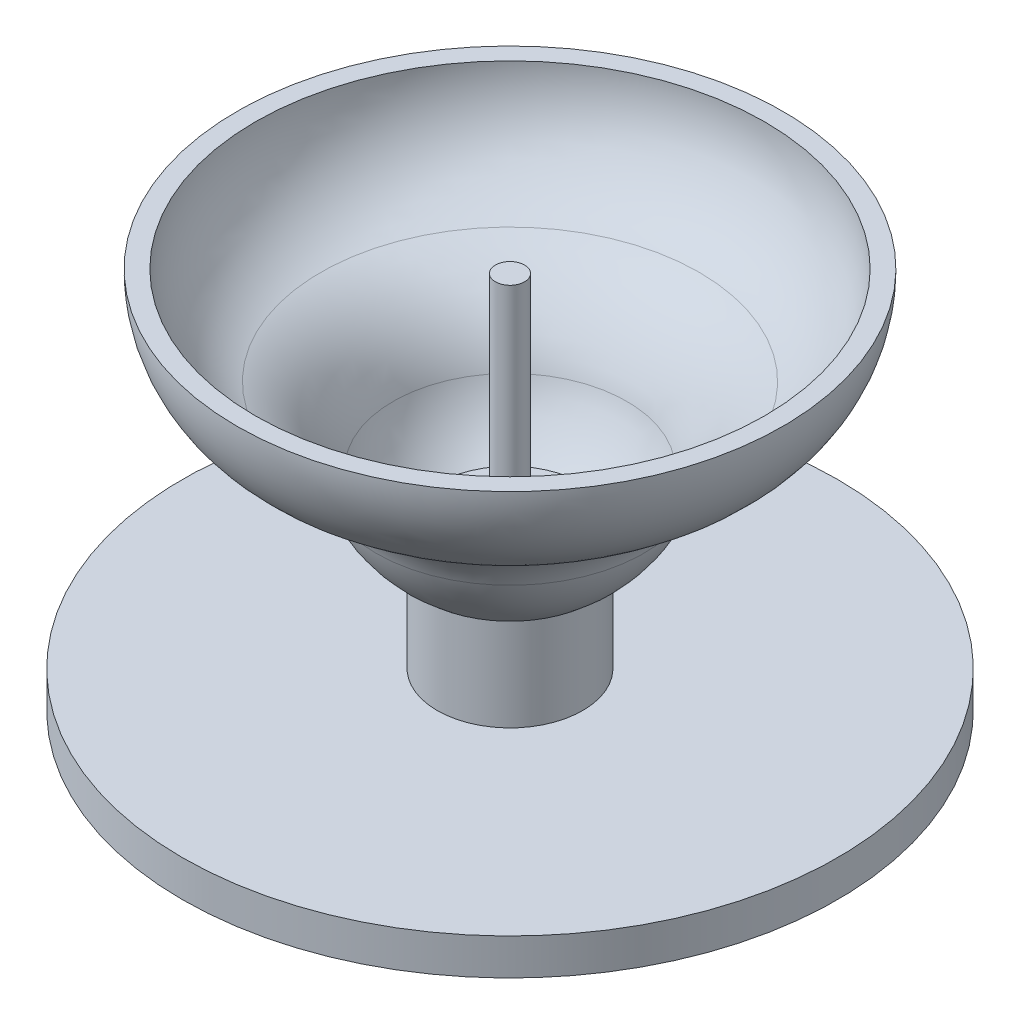
ISO-10303-21;
HEADER;
FILE_DESCRIPTION(('STEP AP214'),'2;1');
FILE_NAME('part.step','',(''),(''),'','','');
FILE_SCHEMA(('AUTOMOTIVE_DESIGN { 1 0 10303 214 1 1 1 1 }'));
ENDSEC;
DATA;
#1=APPLICATION_CONTEXT('core data for automotive mechanical design processes');
#2=APPLICATION_PROTOCOL_DEFINITION('international standard','automotive_design',2000,#1);
#3=PRODUCT_CONTEXT('',#1,'mechanical');
#4=PRODUCT('Part','Part','',(#3));
#5=PRODUCT_RELATED_PRODUCT_CATEGORY('part','',(#4));
#6=PRODUCT_DEFINITION_FORMATION('','',#4);
#7=PRODUCT_DEFINITION_CONTEXT('part definition',#1,'design');
#8=PRODUCT_DEFINITION('design','',#6,#7);
#9=PRODUCT_DEFINITION_SHAPE('','',#8);
#10=(LENGTH_UNIT() NAMED_UNIT(*) SI_UNIT(.MILLI.,.METRE.));
#11=(NAMED_UNIT(*) PLANE_ANGLE_UNIT() SI_UNIT($,.RADIAN.));
#12=(NAMED_UNIT(*) SI_UNIT($,.STERADIAN.) SOLID_ANGLE_UNIT());
#13=UNCERTAINTY_MEASURE_WITH_UNIT(LENGTH_MEASURE(1.E-05),#10,'distance_accuracy_value','');
#14=(GEOMETRIC_REPRESENTATION_CONTEXT(3) GLOBAL_UNCERTAINTY_ASSIGNED_CONTEXT((#13)) GLOBAL_UNIT_ASSIGNED_CONTEXT((#10,
#11,#12)) REPRESENTATION_CONTEXT('',''));
#15=CARTESIAN_POINT('',(0.,0.,0.));
#16=DIRECTION('',(0.,0.,1.));
#17=DIRECTION('',(1.,0.,0.));
#18=AXIS2_PLACEMENT_3D('',#15,#16,#17);
#19=CARTESIAN_POINT('',(0.,103.,0.));
#20=DIRECTION('',(0.,-1.,0.));
#21=DIRECTION('',(0.,0.,-1.));
#22=AXIS2_PLACEMENT_3D('',#19,#20,#21);
#23=CYLINDRICAL_SURFACE('',#22,20.);
#24=CARTESIAN_POINT('',(0.,41.4705656902837,0.));
#25=DIRECTION('',(0.,1.,0.));
#26=DIRECTION('',(0.,0.,1.));
#27=AXIS2_PLACEMENT_3D('',#24,#25,#26);
#28=CIRCLE('',#27,20.);
#29=CARTESIAN_POINT('',(0.,41.4705656902837,20.));
#30=VERTEX_POINT('',#29);
#31=EDGE_CURVE('E58',#30,#30,#28,.F.);
#32=ORIENTED_EDGE('',*,*,#31,.F.);
#33=EDGE_LOOP('',(#32));
#34=FACE_BOUND('',#33,.T.);
#35=CARTESIAN_POINT('',(0.,44.,0.));
#36=DIRECTION('',(0.,1.,0.));
#37=DIRECTION('',(0.,0.,1.));
#38=AXIS2_PLACEMENT_3D('',#35,#36,#37);
#39=CIRCLE('',#38,20.);
#40=CARTESIAN_POINT('',(0.,44.,20.));
#41=VERTEX_POINT('',#40);
#42=EDGE_CURVE('E70',#41,#41,#39,.T.);
#43=ORIENTED_EDGE('',*,*,#42,.F.);
#44=EDGE_LOOP('',(#43));
#45=FACE_BOUND('',#44,.T.);
#46=ADVANCED_FACE('F54',(#34,#45),#23,.T.);
#47=CARTESIAN_POINT('',(0.,10.,0.));
#48=DIRECTION('',(0.,-1.,0.));
#49=DIRECTION('',(0.,0.,-1.));
#50=AXIS2_PLACEMENT_3D('',#47,#48,#49);
#51=CYLINDRICAL_SURFACE('',#50,90.);
#52=CARTESIAN_POINT('',(0.,10.,0.));
#53=DIRECTION('',(0.,1.,0.));
#54=DIRECTION('',(0.,0.,1.));
#55=AXIS2_PLACEMENT_3D('',#52,#53,#54);
#56=CIRCLE('',#55,90.);
#57=CARTESIAN_POINT('',(0.,10.,90.));
#58=VERTEX_POINT('',#57);
#59=EDGE_CURVE('E131',#58,#58,#56,.T.);
#60=ORIENTED_EDGE('',*,*,#59,.F.);
#61=EDGE_LOOP('',(#60));
#62=FACE_BOUND('',#61,.T.);
#63=CARTESIAN_POINT('',(0.,0.,0.));
#64=DIRECTION('',(0.,1.,0.));
#65=DIRECTION('',(0.,0.,1.));
#66=AXIS2_PLACEMENT_3D('',#63,#64,#65);
#67=CIRCLE('',#66,90.);
#68=CARTESIAN_POINT('',(0.,0.,90.));
#69=VERTEX_POINT('',#68);
#70=EDGE_CURVE('E128',#69,#69,#67,.T.);
#71=ORIENTED_EDGE('',*,*,#70,.T.);
#72=EDGE_LOOP('',(#71));
#73=FACE_BOUND('',#72,.T.);
#74=ADVANCED_FACE('F56',(#62,#73),#51,.T.);
#75=CARTESIAN_POINT('',(0.,10.,0.));
#76=DIRECTION('',(0.,1.,0.));
#77=DIRECTION('',(0.,0.,1.));
#78=AXIS2_PLACEMENT_3D('',#75,#76,#77);
#79=PLANE('',#78);
#80=CARTESIAN_POINT('',(0.,10.,0.));
#81=DIRECTION('',(0.,1.,0.));
#82=DIRECTION('',(0.,0.,1.));
#83=AXIS2_PLACEMENT_3D('',#80,#81,#82);
#84=CIRCLE('',#83,20.);
#85=CARTESIAN_POINT('',(0.,10.,20.));
#86=VERTEX_POINT('',#85);
#87=EDGE_CURVE('E66',#86,#86,#84,.T.);
#88=ORIENTED_EDGE('',*,*,#87,.F.);
#89=EDGE_LOOP('',(#88));
#90=FACE_BOUND('',#89,.T.);
#91=ORIENTED_EDGE('',*,*,#59,.T.);
#92=EDGE_LOOP('',(#91));
#93=FACE_BOUND('',#92,.T.);
#94=ADVANCED_FACE('F166',(#90,#93),#79,.T.);
#95=CARTESIAN_POINT('',(0.,0.,0.));
#96=DIRECTION('',(0.,1.,0.));
#97=DIRECTION('',(0.,0.,1.));
#98=AXIS2_PLACEMENT_3D('',#95,#96,#97);
#99=PLANE('',#98);
#100=CARTESIAN_POINT('',(0.,0.,0.));
#101=DIRECTION('',(0.,-1.,0.));
#102=DIRECTION('',(0.,0.,-1.));
#103=AXIS2_PLACEMENT_3D('',#100,#101,#102);
#104=CIRCLE('',#103,75.);
#105=CARTESIAN_POINT('',(0.,0.,-75.));
#106=VERTEX_POINT('',#105);
#107=EDGE_CURVE('E119',#106,#106,#104,.T.);
#108=ORIENTED_EDGE('',*,*,#107,.F.);
#109=EDGE_LOOP('',(#108));
#110=FACE_BOUND('',#109,.T.);
#111=ORIENTED_EDGE('',*,*,#70,.F.);
#112=EDGE_LOOP('',(#111));
#113=FACE_BOUND('',#112,.T.);
#114=ADVANCED_FACE('F174',(#110,#113),#99,.F.);
#115=CARTESIAN_POINT('',(0.,35.4949580064516,0.));
#116=DIRECTION('',(0.,1.,0.));
#117=DIRECTION('',(0.,0.,1.));
#118=AXIS2_PLACEMENT_3D('',#115,#116,#117);
#119=CIRCLE('',#118,20.);
#120=CARTESIAN_POINT('',(0.,35.4949580064516,20.));
#121=VERTEX_POINT('',#120);
#122=EDGE_CURVE('E91',#121,#121,#119,.F.);
#123=ORIENTED_EDGE('',*,*,#122,.T.);
#124=EDGE_LOOP('',(#123));
#125=FACE_BOUND('',#124,.T.);
#126=ORIENTED_EDGE('',*,*,#87,.T.);
#127=EDGE_LOOP('',(#126));
#128=FACE_BOUND('',#127,.T.);
#129=ADVANCED_FACE('F138',(#125,#128),#23,.T.);
#130=CARTESIAN_POINT('',(0.,0.,0.));
#131=DIRECTION('',(0.,1.,0.));
#132=DIRECTION('',(0.,0.,-1.));
#133=AXIS2_PLACEMENT_3D('',#130,#131,#132);
#134=CONICAL_SURFACE('',#133,72.,0.5235987755983);
#135=CARTESIAN_POINT('',(0.,1.,0.));
#136=DIRECTION('',(0.,-1.,0.));
#137=DIRECTION('',(0.,0.,-1.));
#138=AXIS2_PLACEMENT_3D('',#135,#136,#137);
#139=CIRCLE('',#138,72.5773502691896);
#140=CARTESIAN_POINT('',(0.,1.,-72.5773502691896));
#141=VERTEX_POINT('',#140);
#142=EDGE_CURVE('E122',#141,#141,#139,.T.);
#143=ORIENTED_EDGE('',*,*,#142,.T.);
#144=EDGE_LOOP('',(#143));
#145=FACE_BOUND('',#144,.T.);
#146=CARTESIAN_POINT('',(0.,0.,0.));
#147=DIRECTION('',(0.,-1.,0.));
#148=DIRECTION('',(0.,0.,-1.));
#149=AXIS2_PLACEMENT_3D('',#146,#147,#148);
#150=CIRCLE('',#149,72.);
#151=CARTESIAN_POINT('',(0.,0.,-72.));
#152=VERTEX_POINT('',#151);
#153=EDGE_CURVE('E116',#152,#152,#150,.T.);
#154=ORIENTED_EDGE('',*,*,#153,.F.);
#155=EDGE_LOOP('',(#154));
#156=FACE_BOUND('',#155,.T.);
#157=ADVANCED_FACE('F173',(#145,#156),#134,.T.);
#158=CARTESIAN_POINT('',(0.,0.,0.));
#159=DIRECTION('',(0.,-1.,0.));
#160=DIRECTION('',(0.,0.,-1.));
#161=AXIS2_PLACEMENT_3D('',#158,#159,#160);
#162=CONICAL_SURFACE('',#161,75.,0.5235987755983);
#163=CARTESIAN_POINT('',(0.,1.,0.));
#164=DIRECTION('',(0.,-1.,0.));
#165=DIRECTION('',(0.,0.,-1.));
#166=AXIS2_PLACEMENT_3D('',#163,#164,#165);
#167=CIRCLE('',#166,74.4226497308103);
#168=CARTESIAN_POINT('',(0.,1.,-74.4226497308103));
#169=VERTEX_POINT('',#168);
#170=EDGE_CURVE('E125',#169,#169,#167,.T.);
#171=ORIENTED_EDGE('',*,*,#170,.F.);
#172=EDGE_LOOP('',(#171));
#173=FACE_BOUND('',#172,.T.);
#174=ORIENTED_EDGE('',*,*,#107,.T.);
#175=EDGE_LOOP('',(#174));
#176=FACE_BOUND('',#175,.T.);
#177=ADVANCED_FACE('F179',(#173,#176),#162,.F.);
#178=CARTESIAN_POINT('',(0.,1.,0.));
#179=DIRECTION('',(0.,-1.,0.));
#180=DIRECTION('',(0.,0.,-1.));
#181=AXIS2_PLACEMENT_3D('',#178,#179,#180);
#182=PLANE('',#181);
#183=ORIENTED_EDGE('',*,*,#142,.F.);
#184=EDGE_LOOP('',(#183));
#185=FACE_BOUND('',#184,.T.);
#186=ORIENTED_EDGE('',*,*,#170,.T.);
#187=EDGE_LOOP('',(#186));
#188=FACE_BOUND('',#187,.T.);
#189=ADVANCED_FACE('F197',(#185,#188),#182,.T.);
#190=CARTESIAN_POINT('',(0.,0.,0.));
#191=DIRECTION('',(0.,-1.,0.));
#192=DIRECTION('',(0.,0.,-1.));
#193=AXIS2_PLACEMENT_3D('',#190,#191,#192);
#194=CIRCLE('',#193,57.);
#195=CARTESIAN_POINT('',(0.,0.,-57.));
#196=VERTEX_POINT('',#195);
#197=EDGE_CURVE('E107',#196,#196,#194,.T.);
#198=ORIENTED_EDGE('',*,*,#197,.F.);
#199=EDGE_LOOP('',(#198));
#200=FACE_BOUND('',#199,.T.);
#201=ORIENTED_EDGE('',*,*,#153,.T.);
#202=EDGE_LOOP('',(#201));
#203=FACE_BOUND('',#202,.T.);
#204=ADVANCED_FACE('F184',(#200,#203),#99,.F.);
#205=CARTESIAN_POINT('',(0.,0.,0.));
#206=DIRECTION('',(0.,1.,0.));
#207=DIRECTION('',(0.,0.,-1.));
#208=AXIS2_PLACEMENT_3D('',#205,#206,#207);
#209=CONICAL_SURFACE('',#208,54.,0.5235987755983);
#210=CARTESIAN_POINT('',(0.,1.,0.));
#211=DIRECTION('',(0.,-1.,0.));
#212=DIRECTION('',(0.,0.,-1.));
#213=AXIS2_PLACEMENT_3D('',#210,#211,#212);
#214=CIRCLE('',#213,54.5773502691896);
#215=CARTESIAN_POINT('',(0.,1.,-54.5773502691896));
#216=VERTEX_POINT('',#215);
#217=EDGE_CURVE('E110',#216,#216,#214,.T.);
#218=ORIENTED_EDGE('',*,*,#217,.T.);
#219=EDGE_LOOP('',(#218));
#220=FACE_BOUND('',#219,.T.);
#221=CARTESIAN_POINT('',(0.,0.,0.));
#222=DIRECTION('',(0.,-1.,0.));
#223=DIRECTION('',(0.,0.,-1.));
#224=AXIS2_PLACEMENT_3D('',#221,#222,#223);
#225=CIRCLE('',#224,54.);
#226=CARTESIAN_POINT('',(0.,0.,-54.));
#227=VERTEX_POINT('',#226);
#228=EDGE_CURVE('E104',#227,#227,#225,.T.);
#229=ORIENTED_EDGE('',*,*,#228,.F.);
#230=EDGE_LOOP('',(#229));
#231=FACE_BOUND('',#230,.T.);
#232=ADVANCED_FACE('F196',(#220,#231),#209,.T.);
#233=CARTESIAN_POINT('',(0.,0.,0.));
#234=DIRECTION('',(0.,-1.,0.));
#235=DIRECTION('',(0.,0.,-1.));
#236=AXIS2_PLACEMENT_3D('',#233,#234,#235);
#237=CONICAL_SURFACE('',#236,57.,0.5235987755983);
#238=CARTESIAN_POINT('',(0.,1.,0.));
#239=DIRECTION('',(0.,-1.,0.));
#240=DIRECTION('',(0.,0.,-1.));
#241=AXIS2_PLACEMENT_3D('',#238,#239,#240);
#242=CIRCLE('',#241,56.4226497308103);
#243=CARTESIAN_POINT('',(0.,1.,-56.4226497308103));
#244=VERTEX_POINT('',#243);
#245=EDGE_CURVE('E113',#244,#244,#242,.T.);
#246=ORIENTED_EDGE('',*,*,#245,.F.);
#247=EDGE_LOOP('',(#246));
#248=FACE_BOUND('',#247,.T.);
#249=ORIENTED_EDGE('',*,*,#197,.T.);
#250=EDGE_LOOP('',(#249));
#251=FACE_BOUND('',#250,.T.);
#252=ADVANCED_FACE('F203',(#248,#251),#237,.F.);
#253=CARTESIAN_POINT('',(0.,1.,0.));
#254=DIRECTION('',(0.,-1.,0.));
#255=DIRECTION('',(0.,0.,-1.));
#256=AXIS2_PLACEMENT_3D('',#253,#254,#255);
#257=PLANE('',#256);
#258=ORIENTED_EDGE('',*,*,#217,.F.);
#259=EDGE_LOOP('',(#258));
#260=FACE_BOUND('',#259,.T.);
#261=ORIENTED_EDGE('',*,*,#245,.T.);
#262=EDGE_LOOP('',(#261));
#263=FACE_BOUND('',#262,.T.);
#264=ADVANCED_FACE('F193',(#260,#263),#257,.T.);
#265=CARTESIAN_POINT('',(0.,0.,0.));
#266=DIRECTION('',(0.,-1.,0.));
#267=DIRECTION('',(0.,0.,-1.));
#268=AXIS2_PLACEMENT_3D('',#265,#266,#267);
#269=CIRCLE('',#268,39.);
#270=CARTESIAN_POINT('',(0.,0.,-39.));
#271=VERTEX_POINT('',#270);
#272=EDGE_CURVE('E95',#271,#271,#269,.T.);
#273=ORIENTED_EDGE('',*,*,#272,.F.);
#274=EDGE_LOOP('',(#273));
#275=FACE_BOUND('',#274,.T.);
#276=ORIENTED_EDGE('',*,*,#228,.T.);
#277=EDGE_LOOP('',(#276));
#278=FACE_BOUND('',#277,.T.);
#279=ADVANCED_FACE('F183',(#275,#278),#99,.F.);
#280=CARTESIAN_POINT('',(0.,0.,0.));
#281=DIRECTION('',(0.,1.,0.));
#282=DIRECTION('',(0.,0.,-1.));
#283=AXIS2_PLACEMENT_3D('',#280,#281,#282);
#284=CONICAL_SURFACE('',#283,36.,0.5235987755983);
#285=CARTESIAN_POINT('',(0.,1.,0.));
#286=DIRECTION('',(0.,-1.,0.));
#287=DIRECTION('',(0.,0.,-1.));
#288=AXIS2_PLACEMENT_3D('',#285,#286,#287);
#289=CIRCLE('',#288,36.5773502691896);
#290=CARTESIAN_POINT('',(0.,1.,-36.5773502691896));
#291=VERTEX_POINT('',#290);
#292=EDGE_CURVE('E98',#291,#291,#289,.T.);
#293=ORIENTED_EDGE('',*,*,#292,.T.);
#294=EDGE_LOOP('',(#293));
#295=FACE_BOUND('',#294,.T.);
#296=CARTESIAN_POINT('',(0.,0.,0.));
#297=DIRECTION('',(0.,-1.,0.));
#298=DIRECTION('',(0.,0.,-1.));
#299=AXIS2_PLACEMENT_3D('',#296,#297,#298);
#300=CIRCLE('',#299,36.);
#301=CARTESIAN_POINT('',(0.,0.,-36.));
#302=VERTEX_POINT('',#301);
#303=EDGE_CURVE('E92',#302,#302,#300,.T.);
#304=ORIENTED_EDGE('',*,*,#303,.F.);
#305=EDGE_LOOP('',(#304));
#306=FACE_BOUND('',#305,.T.);
#307=ADVANCED_FACE('F192',(#295,#306),#284,.T.);
#308=CARTESIAN_POINT('',(0.,0.,0.));
#309=DIRECTION('',(0.,-1.,0.));
#310=DIRECTION('',(0.,0.,-1.));
#311=AXIS2_PLACEMENT_3D('',#308,#309,#310);
#312=CONICAL_SURFACE('',#311,39.,0.5235987755983);
#313=CARTESIAN_POINT('',(0.,1.,0.));
#314=DIRECTION('',(0.,-1.,0.));
#315=DIRECTION('',(0.,0.,-1.));
#316=AXIS2_PLACEMENT_3D('',#313,#314,#315);
#317=CIRCLE('',#316,38.4226497308104);
#318=CARTESIAN_POINT('',(0.,1.,-38.4226497308104));
#319=VERTEX_POINT('',#318);
#320=EDGE_CURVE('E101',#319,#319,#317,.T.);
#321=ORIENTED_EDGE('',*,*,#320,.F.);
#322=EDGE_LOOP('',(#321));
#323=FACE_BOUND('',#322,.T.);
#324=ORIENTED_EDGE('',*,*,#272,.T.);
#325=EDGE_LOOP('',(#324));
#326=FACE_BOUND('',#325,.T.);
#327=ADVANCED_FACE('F216',(#323,#326),#312,.F.);
#328=CARTESIAN_POINT('',(0.,1.,0.));
#329=DIRECTION('',(0.,-1.,0.));
#330=DIRECTION('',(0.,0.,-1.));
#331=AXIS2_PLACEMENT_3D('',#328,#329,#330);
#332=PLANE('',#331);
#333=ORIENTED_EDGE('',*,*,#292,.F.);
#334=EDGE_LOOP('',(#333));
#335=FACE_BOUND('',#334,.T.);
#336=ORIENTED_EDGE('',*,*,#320,.T.);
#337=EDGE_LOOP('',(#336));
#338=FACE_BOUND('',#337,.T.);
#339=ADVANCED_FACE('F211',(#335,#338),#332,.T.);
#340=ORIENTED_EDGE('',*,*,#303,.T.);
#341=EDGE_LOOP('',(#340));
#342=FACE_BOUND('',#341,.T.);
#343=ADVANCED_FACE('F154',(#342),#99,.F.);
#344=CARTESIAN_POINT('',(0.,69.1444814489553,0.));
#345=DIRECTION('',(0.,1.,0.));
#346=DIRECTION('',(0.,0.,1.));
#347=AXIS2_PLACEMENT_3D('',#344,#345,#346);
#348=SPHERICAL_SURFACE('',#347,34.1444814489554);
#349=CARTESIAN_POINT('',(0.,57.5167317239771,0.));
#350=DIRECTION('',(0.,1.,0.));
#351=DIRECTION('',(0.,0.,1.));
#352=AXIS2_PLACEMENT_3D('',#349,#350,#351);
#353=CIRCLE('',#352,32.10359870406);
#354=CARTESIAN_POINT('',(0.,57.5167317239771,32.10359870406));
#355=VERTEX_POINT('',#354);
#356=EDGE_CURVE('E88',#355,#355,#353,.T.);
#357=ORIENTED_EDGE('',*,*,#356,.T.);
#358=EDGE_LOOP('',(#357));
#359=FACE_BOUND('',#358,.T.);
#360=ORIENTED_EDGE('',*,*,#31,.T.);
#361=EDGE_LOOP('',(#360));
#362=FACE_BOUND('',#361,.T.);
#363=ADVANCED_FACE('F144',(#359,#362),#348,.F.);
#364=CARTESIAN_POINT('',(0.,69.1444814489553,0.));
#365=DIRECTION('',(0.,1.,0.));
#366=DIRECTION('',(0.,0.,1.));
#367=AXIS2_PLACEMENT_3D('',#364,#365,#366);
#368=SPHERICAL_SURFACE('',#367,39.1444814489554);
#369=CARTESIAN_POINT('',(0.,55.8140041920974,0.));
#370=DIRECTION('',(0.,1.,0.));
#371=DIRECTION('',(0.,0.,1.));
#372=AXIS2_PLACEMENT_3D('',#369,#370,#371);
#373=CIRCLE('',#372,36.8047388798237);
#374=CARTESIAN_POINT('',(0.,55.8140041920974,36.8047388798237));
#375=VERTEX_POINT('',#374);
#376=EDGE_CURVE('E73',#375,#375,#373,.T.);
#377=ORIENTED_EDGE('',*,*,#376,.F.);
#378=EDGE_LOOP('',(#377));
#379=FACE_BOUND('',#378,.T.);
#380=ORIENTED_EDGE('',*,*,#122,.F.);
#381=EDGE_LOOP('',(#380));
#382=FACE_BOUND('',#381,.T.);
#383=ADVANCED_FACE('F141',(#379,#382),#368,.T.);
#384=CARTESIAN_POINT('',(0.,45.4236943411388,0.));
#385=DIRECTION('',(0.,1.,0.));
#386=DIRECTION('',(0.,0.,1.));
#387=AXIS2_PLACEMENT_3D('',#384,#385,#386);
#388=TOROIDAL_SURFACE('',#387,65.4918318905602,35.5107824253259);
#389=ORIENTED_EDGE('',*,*,#356,.F.);
#390=EDGE_LOOP('',(#389));
#391=FACE_BOUND('',#390,.T.);
#392=CARTESIAN_POINT('',(0.,78.2687275096406,0.));
#393=DIRECTION('',(0.,1.,0.));
#394=DIRECTION('',(0.,0.,1.));
#395=AXIS2_PLACEMENT_3D('',#392,#393,#394);
#396=CIRCLE('',#395,51.992962877978);
#397=CARTESIAN_POINT('',(0.,78.2687275096406,51.992962877978));
#398=VERTEX_POINT('',#397);
#399=EDGE_CURVE('E85',#398,#398,#396,.T.);
#400=ORIENTED_EDGE('',*,*,#399,.T.);
#401=EDGE_LOOP('',(#400));
#402=FACE_BOUND('',#401,.T.);
#403=ADVANCED_FACE('F143',(#391,#402),#388,.T.);
#404=CARTESIAN_POINT('',(0.,105.094254482916,0.));
#405=DIRECTION('',(0.,1.,0.));
#406=DIRECTION('',(0.,0.,1.));
#407=AXIS2_PLACEMENT_3D('',#404,#405,#406);
#408=TOROIDAL_SURFACE('',#407,40.9680303425772,29.0027246100094);
#409=ORIENTED_EDGE('',*,*,#399,.F.);
#410=EDGE_LOOP('',(#409));
#411=FACE_BOUND('',#410,.T.);
#412=CARTESIAN_POINT('',(0.,105.094254482916,0.));
#413=DIRECTION('',(0.,1.,0.));
#414=DIRECTION('',(0.,0.,1.));
#415=AXIS2_PLACEMENT_3D('',#412,#413,#414);
#416=CIRCLE('',#415,69.9707549525866);
#417=CARTESIAN_POINT('',(0.,105.094254482916,69.9707549525866));
#418=VERTEX_POINT('',#417);
#419=EDGE_CURVE('E82',#418,#418,#416,.T.);
#420=ORIENTED_EDGE('',*,*,#419,.T.);
#421=EDGE_LOOP('',(#420));
#422=FACE_BOUND('',#421,.T.);
#423=ADVANCED_FACE('F151',(#411,#422),#408,.F.);
#424=CARTESIAN_POINT('',(0.,105.094254482916,0.));
#425=DIRECTION('',(0.,-1.,0.));
#426=DIRECTION('',(0.,0.,-1.));
#427=AXIS2_PLACEMENT_3D('',#424,#425,#426);
#428=PLANE('',#427);
#429=ORIENTED_EDGE('',*,*,#419,.F.);
#430=EDGE_LOOP('',(#429));
#431=FACE_BOUND('',#430,.T.);
#432=CARTESIAN_POINT('',(0.,105.094254482916,0.));
#433=DIRECTION('',(0.,1.,0.));
#434=DIRECTION('',(0.,0.,1.));
#435=AXIS2_PLACEMENT_3D('',#432,#433,#434);
#436=CIRCLE('',#435,74.9707549525866);
#437=CARTESIAN_POINT('',(0.,105.094254482916,74.9707549525866));
#438=VERTEX_POINT('',#437);
#439=EDGE_CURVE('E79',#438,#438,#436,.T.);
#440=ORIENTED_EDGE('',*,*,#439,.T.);
#441=EDGE_LOOP('',(#440));
#442=FACE_BOUND('',#441,.T.);
#443=ADVANCED_FACE('F353',(#431,#442),#428,.F.);
#444=CARTESIAN_POINT('',(0.,105.094254482916,0.));
#445=DIRECTION('',(0.,1.,0.));
#446=DIRECTION('',(0.,0.,1.));
#447=AXIS2_PLACEMENT_3D('',#444,#445,#446);
#448=TOROIDAL_SURFACE('',#447,40.9680303425772,34.0027246100094);
#449=CARTESIAN_POINT('',(0.,73.6440711482143,0.));
#450=DIRECTION('',(0.,1.,0.));
#451=DIRECTION('',(0.,0.,1.));
#452=AXIS2_PLACEMENT_3D('',#449,#450,#451);
#453=CIRCLE('',#452,53.8936347430612);
#454=CARTESIAN_POINT('',(0.,73.6440711482143,53.8936347430612));
#455=VERTEX_POINT('',#454);
#456=EDGE_CURVE('E76',#455,#455,#453,.T.);
#457=ORIENTED_EDGE('',*,*,#456,.T.);
#458=EDGE_LOOP('',(#457));
#459=FACE_BOUND('',#458,.T.);
#460=ORIENTED_EDGE('',*,*,#439,.F.);
#461=EDGE_LOOP('',(#460));
#462=FACE_BOUND('',#461,.T.);
#463=ADVANCED_FACE('F343',(#459,#462),#448,.T.);
#464=CARTESIAN_POINT('',(0.,45.4236943411388,0.));
#465=DIRECTION('',(0.,1.,0.));
#466=DIRECTION('',(0.,0.,1.));
#467=AXIS2_PLACEMENT_3D('',#464,#465,#466);
#468=TOROIDAL_SURFACE('',#467,65.4918318905602,30.5107824253259);
#469=ORIENTED_EDGE('',*,*,#376,.T.);
#470=EDGE_LOOP('',(#469));
#471=FACE_BOUND('',#470,.T.);
#472=ORIENTED_EDGE('',*,*,#456,.F.);
#473=EDGE_LOOP('',(#472));
#474=FACE_BOUND('',#473,.T.);
#475=ADVANCED_FACE('F329',(#471,#474),#468,.F.);
#476=CARTESIAN_POINT('',(0.,44.,0.));
#477=DIRECTION('',(0.,1.,0.));
#478=DIRECTION('',(0.,0.,1.));
#479=AXIS2_PLACEMENT_3D('',#476,#477,#478);
#480=PLANE('',#479);
#481=CARTESIAN_POINT('',(0.,44.,0.));
#482=DIRECTION('',(0.,1.,0.));
#483=DIRECTION('',(0.,0.,1.));
#484=AXIS2_PLACEMENT_3D('',#481,#482,#483);
#485=CIRCLE('',#484,4.);
#486=CARTESIAN_POINT('',(0.,44.,4.));
#487=VERTEX_POINT('',#486);
#488=EDGE_CURVE('E11',#487,#487,#485,.T.);
#489=ORIENTED_EDGE('',*,*,#488,.F.);
#490=EDGE_LOOP('',(#489));
#491=FACE_BOUND('',#490,.T.);
#492=ORIENTED_EDGE('',*,*,#42,.T.);
#493=EDGE_LOOP('',(#492));
#494=FACE_BOUND('',#493,.T.);
#495=ADVANCED_FACE('F304',(#491,#494),#480,.T.);
#496=CARTESIAN_POINT('',(0.,104.,0.));
#497=DIRECTION('',(0.,-1.,0.));
#498=DIRECTION('',(0.,0.,-1.));
#499=AXIS2_PLACEMENT_3D('',#496,#497,#498);
#500=CYLINDRICAL_SURFACE('',#499,4.);
#501=CARTESIAN_POINT('',(0.,104.,0.));
#502=DIRECTION('',(0.,1.,0.));
#503=DIRECTION('',(0.,0.,1.));
#504=AXIS2_PLACEMENT_3D('',#501,#502,#503);
#505=CIRCLE('',#504,4.);
#506=CARTESIAN_POINT('',(0.,104.,4.));
#507=VERTEX_POINT('',#506);
#508=EDGE_CURVE('E69',#507,#507,#505,.T.);
#509=ORIENTED_EDGE('',*,*,#508,.F.);
#510=EDGE_LOOP('',(#509));
#511=FACE_BOUND('',#510,.T.);
#512=ORIENTED_EDGE('',*,*,#488,.T.);
#513=EDGE_LOOP('',(#512));
#514=FACE_BOUND('',#513,.T.);
#515=ADVANCED_FACE('F298',(#511,#514),#500,.T.);
#516=CARTESIAN_POINT('',(0.,104.,0.));
#517=DIRECTION('',(0.,1.,0.));
#518=DIRECTION('',(0.,0.,1.));
#519=AXIS2_PLACEMENT_3D('',#516,#517,#518);
#520=PLANE('',#519);
#521=ORIENTED_EDGE('',*,*,#508,.T.);
#522=EDGE_LOOP('',(#521));
#523=FACE_BOUND('',#522,.T.);
#524=ADVANCED_FACE('F303',(#523),#520,.T.);
#525=CLOSED_SHELL('',(#46,#74,#94,#114,#129,#157,#177,#189,#204,#232,#252,#264,#279,#307,#327,
#339,#343,#363,#383,#403,#423,#443,#463,#475,#495,#515,#524));
#526=MANIFOLD_SOLID_BREP('B2',#525);
#527=ADVANCED_BREP_SHAPE_REPRESENTATION('',(#18,#526),#14);
#528=SHAPE_DEFINITION_REPRESENTATION(#9,#527);
ENDSEC;
END-ISO-10303-21;
